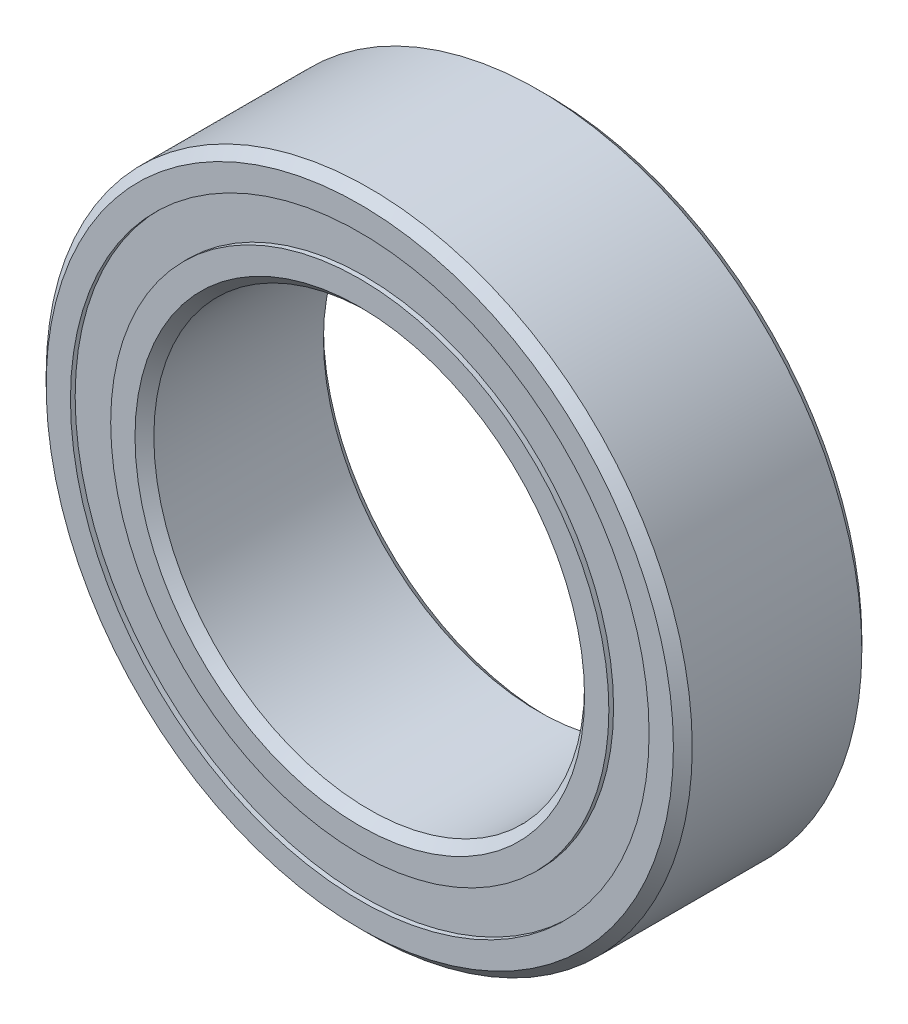
ISO-10303-21;
HEADER;
FILE_DESCRIPTION(('STEP AP214'),'2;1');
FILE_NAME('part.step','',(''),(''),'','','');
FILE_SCHEMA(('AUTOMOTIVE_DESIGN { 1 0 10303 214 1 1 1 1 }'));
ENDSEC;
DATA;
#1=APPLICATION_CONTEXT('core data for automotive mechanical design processes');
#2=APPLICATION_PROTOCOL_DEFINITION('international standard','automotive_design',2000,#1);
#3=PRODUCT_CONTEXT('',#1,'mechanical');
#4=PRODUCT('Part','Part','',(#3));
#5=PRODUCT_RELATED_PRODUCT_CATEGORY('part','',(#4));
#6=PRODUCT_DEFINITION_FORMATION('','',#4);
#7=PRODUCT_DEFINITION_CONTEXT('part definition',#1,'design');
#8=PRODUCT_DEFINITION('design','',#6,#7);
#9=PRODUCT_DEFINITION_SHAPE('','',#8);
#10=(LENGTH_UNIT() NAMED_UNIT(*) SI_UNIT(.MILLI.,.METRE.));
#11=(NAMED_UNIT(*) PLANE_ANGLE_UNIT() SI_UNIT($,.RADIAN.));
#12=(NAMED_UNIT(*) SI_UNIT($,.STERADIAN.) SOLID_ANGLE_UNIT());
#13=UNCERTAINTY_MEASURE_WITH_UNIT(LENGTH_MEASURE(1.E-05),#10,'distance_accuracy_value','');
#14=(GEOMETRIC_REPRESENTATION_CONTEXT(3) GLOBAL_UNCERTAINTY_ASSIGNED_CONTEXT((#13)) GLOBAL_UNIT_ASSIGNED_CONTEXT((#10,
#11,#12)) REPRESENTATION_CONTEXT('',''));
#15=CARTESIAN_POINT('',(0.,0.,0.));
#16=DIRECTION('',(0.,0.,1.));
#17=DIRECTION('',(1.,0.,0.));
#18=AXIS2_PLACEMENT_3D('',#15,#16,#17);
#19=CARTESIAN_POINT('',(0.,5.825,1.75));
#20=DIRECTION('',(0.,0.,-1.));
#21=DIRECTION('',(0.,-1.,0.));
#22=AXIS2_PLACEMENT_3D('',#19,#20,#21);
#23=PLANE('',#22);
#24=CARTESIAN_POINT('',(0.,0.,1.75));
#25=DIRECTION('',(0.,0.,1.));
#26=DIRECTION('',(1.,0.,0.));
#27=AXIS2_PLACEMENT_3D('',#24,#25,#26);
#28=CIRCLE('',#27,5.37362637362637);
#29=CARTESIAN_POINT('',(5.37362637362637,0.,1.75));
#30=VERTEX_POINT('',#29);
#31=EDGE_CURVE('P0_E61',#30,#30,#28,.T.);
#32=ORIENTED_EDGE('',*,*,#31,.F.);
#33=EDGE_LOOP('',(#32));
#34=FACE_BOUND('',#33,.T.);
#35=CARTESIAN_POINT('',(0.,0.,1.75));
#36=DIRECTION('',(0.,0.,1.));
#37=DIRECTION('',(1.,0.,0.));
#38=AXIS2_PLACEMENT_3D('',#35,#36,#37);
#39=CIRCLE('',#38,5.825);
#40=CARTESIAN_POINT('',(5.825,0.,1.75));
#41=VERTEX_POINT('',#40);
#42=EDGE_CURVE('P0_E10',#41,#41,#39,.T.);
#43=ORIENTED_EDGE('',*,*,#42,.T.);
#44=EDGE_LOOP('',(#43));
#45=FACE_BOUND('',#44,.T.);
#46=ADVANCED_FACE('P0_F15',(#34,#45),#23,.F.);
#47=CARTESIAN_POINT('',(0.,5.825,-1.75));
#48=DIRECTION('',(0.,0.,1.));
#49=DIRECTION('',(1.,0.,0.));
#50=AXIS2_PLACEMENT_3D('',#47,#48,#49);
#51=PLANE('',#50);
#52=CARTESIAN_POINT('',(0.,0.,-1.75));
#53=DIRECTION('',(0.,0.,1.));
#54=DIRECTION('',(1.,0.,0.));
#55=AXIS2_PLACEMENT_3D('',#52,#53,#54);
#56=CIRCLE('',#55,5.37362637362637);
#57=CARTESIAN_POINT('',(5.37362637362637,0.,-1.75));
#58=VERTEX_POINT('',#57);
#59=EDGE_CURVE('P0_E48',#58,#58,#56,.T.);
#60=ORIENTED_EDGE('',*,*,#59,.T.);
#61=EDGE_LOOP('',(#60));
#62=FACE_BOUND('',#61,.T.);
#63=CARTESIAN_POINT('',(0.,0.,-1.75));
#64=DIRECTION('',(0.,0.,1.));
#65=DIRECTION('',(1.,0.,0.));
#66=AXIS2_PLACEMENT_3D('',#63,#64,#65);
#67=CIRCLE('',#66,5.825);
#68=CARTESIAN_POINT('',(5.825,0.,-1.75));
#69=VERTEX_POINT('',#68);
#70=EDGE_CURVE('P0_E32',#69,#69,#67,.T.);
#71=ORIENTED_EDGE('',*,*,#70,.F.);
#72=EDGE_LOOP('',(#71));
#73=FACE_BOUND('',#72,.T.);
#74=ADVANCED_FACE('P0_F87',(#62,#73),#51,.F.);
#75=CARTESIAN_POINT('',(0.,0.,1.575));
#76=DIRECTION('',(0.,0.,-1.));
#77=DIRECTION('',(-1.,0.,0.));
#78=AXIS2_PLACEMENT_3D('',#75,#76,#77);
#79=CONICAL_SURFACE('',#78,6.,0.785398163397448);
#80=ORIENTED_EDGE('',*,*,#42,.F.);
#81=EDGE_LOOP('',(#80));
#82=FACE_BOUND('',#81,.T.);
#83=CARTESIAN_POINT('',(0.,0.,1.575));
#84=DIRECTION('',(0.,0.,1.));
#85=DIRECTION('',(1.,0.,0.));
#86=AXIS2_PLACEMENT_3D('',#83,#84,#85);
#87=CIRCLE('',#86,6.);
#88=CARTESIAN_POINT('',(6.,0.,1.575));
#89=VERTEX_POINT('',#88);
#90=EDGE_CURVE('P0_E22',#89,#89,#87,.T.);
#91=ORIENTED_EDGE('',*,*,#90,.T.);
#92=EDGE_LOOP('',(#91));
#93=FACE_BOUND('',#92,.T.);
#94=ADVANCED_FACE('P0_F95',(#82,#93),#79,.T.);
#95=CARTESIAN_POINT('',(0.,0.,1.75));
#96=DIRECTION('',(0.,0.,1.));
#97=DIRECTION('',(1.,0.,0.));
#98=AXIS2_PLACEMENT_3D('',#95,#96,#97);
#99=CYLINDRICAL_SURFACE('',#98,6.);
#100=CARTESIAN_POINT('',(0.,0.,-1.575));
#101=DIRECTION('',(0.,0.,1.));
#102=DIRECTION('',(1.,0.,0.));
#103=AXIS2_PLACEMENT_3D('',#100,#101,#102);
#104=CIRCLE('',#103,6.);
#105=CARTESIAN_POINT('',(6.,0.,-1.575));
#106=VERTEX_POINT('',#105);
#107=EDGE_CURVE('P0_E41',#106,#106,#104,.T.);
#108=ORIENTED_EDGE('',*,*,#107,.T.);
#109=EDGE_LOOP('',(#108));
#110=FACE_BOUND('',#109,.T.);
#111=ORIENTED_EDGE('',*,*,#90,.F.);
#112=EDGE_LOOP('',(#111));
#113=FACE_BOUND('',#112,.T.);
#114=ADVANCED_FACE('P0_F100',(#110,#113),#99,.T.);
#115=CARTESIAN_POINT('',(0.,0.,-1.75));
#116=DIRECTION('',(0.,0.,1.));
#117=DIRECTION('',(1.,0.,0.));
#118=AXIS2_PLACEMENT_3D('',#115,#116,#117);
#119=CONICAL_SURFACE('',#118,5.825,0.785398163397447);
#120=ORIENTED_EDGE('',*,*,#70,.T.);
#121=EDGE_LOOP('',(#120));
#122=FACE_BOUND('',#121,.T.);
#123=ORIENTED_EDGE('',*,*,#107,.F.);
#124=EDGE_LOOP('',(#123));
#125=FACE_BOUND('',#124,.T.);
#126=ADVANCED_FACE('P0_F102',(#122,#125),#119,.T.);
#127=CARTESIAN_POINT('',(0.,0.,1.75));
#128=DIRECTION('',(0.,0.,1.));
#129=DIRECTION('',(1.,0.,0.));
#130=AXIS2_PLACEMENT_3D('',#127,#128,#129);
#131=CYLINDRICAL_SURFACE('',#130,5.37362637362637);
#132=CARTESIAN_POINT('',(0.,0.,-0.777777777777777));
#133=DIRECTION('',(0.,0.,1.));
#134=DIRECTION('',(1.,0.,0.));
#135=AXIS2_PLACEMENT_3D('',#132,#133,#134);
#136=CIRCLE('',#135,5.37362637362637);
#137=CARTESIAN_POINT('',(5.37362637362637,0.,-0.777777777777777));
#138=VERTEX_POINT('',#137);
#139=EDGE_CURVE('P0_E42',#138,#138,#136,.T.);
#140=ORIENTED_EDGE('',*,*,#139,.T.);
#141=EDGE_LOOP('',(#140));
#142=FACE_BOUND('',#141,.T.);
#143=ORIENTED_EDGE('',*,*,#59,.F.);
#144=EDGE_LOOP('',(#143));
#145=FACE_BOUND('',#144,.T.);
#146=ADVANCED_FACE('P0_F81',(#142,#145),#131,.F.);
#147=CARTESIAN_POINT('',(0.,0.,0.));
#148=DIRECTION('',(0.,0.,1.));
#149=DIRECTION('',(1.,0.,0.));
#150=AXIS2_PLACEMENT_3D('',#147,#148,#149);
#151=TOROIDAL_SURFACE('',#150,5.,0.862864380232568);
#152=CARTESIAN_POINT('',(0.,0.,0.777777777777777));
#153=DIRECTION('',(0.,0.,1.));
#154=DIRECTION('',(1.,0.,0.));
#155=AXIS2_PLACEMENT_3D('',#152,#153,#154);
#156=CIRCLE('',#155,5.37362637362637);
#157=CARTESIAN_POINT('',(5.37362637362637,0.,0.777777777777777));
#158=VERTEX_POINT('',#157);
#159=EDGE_CURVE('P0_E66',#158,#158,#156,.T.);
#160=ORIENTED_EDGE('',*,*,#159,.T.);
#161=EDGE_LOOP('',(#160));
#162=FACE_BOUND('',#161,.T.);
#163=ORIENTED_EDGE('',*,*,#139,.F.);
#164=EDGE_LOOP('',(#163));
#165=FACE_BOUND('',#164,.T.);
#166=ADVANCED_FACE('P0_F73',(#162,#165),#151,.F.);
#167=CARTESIAN_POINT('',(0.,0.,1.75));
#168=DIRECTION('',(0.,0.,1.));
#169=DIRECTION('',(1.,0.,0.));
#170=AXIS2_PLACEMENT_3D('',#167,#168,#169);
#171=CYLINDRICAL_SURFACE('',#170,5.37362637362637);
#172=ORIENTED_EDGE('',*,*,#31,.T.);
#173=EDGE_LOOP('',(#172));
#174=FACE_BOUND('',#173,.T.);
#175=ORIENTED_EDGE('',*,*,#159,.F.);
#176=EDGE_LOOP('',(#175));
#177=FACE_BOUND('',#176,.T.);
#178=ADVANCED_FACE('P0_F76',(#174,#177),#171,.F.);
#179=CLOSED_SHELL('',(#46,#74,#94,#114,#126,#146,#166,#178));
#180=MANIFOLD_SOLID_BREP('P0_B1',#179);
#181=CARTESIAN_POINT('',(-2.50000000000004,-4.33012701892217,0.));
#182=DIRECTION('',(0.866025403784435,-0.500000000000007,0.));
#183=DIRECTION('',(-0.500000000000007,-0.866025403784435,0.));
#184=AXIS2_PLACEMENT_3D('',#181,#182,#183);
#185=SPHERICAL_SURFACE('',#184,0.862864380232568);
#186=CARTESIAN_POINT('',(-1.75273752669792,-4.76155920903846,0.));
#187=VERTEX_POINT('',#186);
#188=VERTEX_LOOP('',#187);
#189=FACE_BOUND('',#188,.T.);
#190=ADVANCED_FACE('P1_F13',(#189),#185,.T.);
#191=CLOSED_SHELL('',(#190));
#192=MANIFOLD_SOLID_BREP('P1_B1',#191);
#193=CARTESIAN_POINT('',(-4.33012701892222,-2.49999999999996,0.));
#194=DIRECTION('',(0.499999999999992,-0.866025403784443,0.));
#195=DIRECTION('',(-0.866025403784443,-0.499999999999992,0.));
#196=AXIS2_PLACEMENT_3D('',#193,#194,#195);
#197=SPHERICAL_SURFACE('',#196,0.862864380232568);
#198=CARTESIAN_POINT('',(-3.89869482880594,-3.24726247330208,0.));
#199=VERTEX_POINT('',#198);
#200=VERTEX_LOOP('',#199);
#201=FACE_BOUND('',#200,.T.);
#202=ADVANCED_FACE('P2_F13',(#201),#197,.T.);
#203=CLOSED_SHELL('',(#202));
#204=MANIFOLD_SOLID_BREP('P2_B1',#203);
#205=CARTESIAN_POINT('',(-5.,0.,0.));
#206=DIRECTION('',(0.,-1.,0.));
#207=DIRECTION('',(-1.,0.,0.));
#208=AXIS2_PLACEMENT_3D('',#205,#206,#207);
#209=SPHERICAL_SURFACE('',#208,0.862864380232568);
#210=CARTESIAN_POINT('',(-5.00000000000001,-0.862864380232516,0.));
#211=VERTEX_POINT('',#210);
#212=VERTEX_LOOP('',#211);
#213=FACE_BOUND('',#212,.T.);
#214=ADVANCED_FACE('P3_F13',(#213),#209,.T.);
#215=CLOSED_SHELL('',(#214));
#216=MANIFOLD_SOLID_BREP('P3_B1',#215);
#217=CARTESIAN_POINT('',(-4.33012701892217,2.50000000000005,0.));
#218=DIRECTION('',(-0.50000000000001,-0.866025403784433,0.));
#219=DIRECTION('',(-0.866025403784433,0.50000000000001,0.));
#220=AXIS2_PLACEMENT_3D('',#217,#218,#219);
#221=SPHERICAL_SURFACE('',#220,0.862864380232568);
#222=CARTESIAN_POINT('',(-4.76155920903846,1.75273752669794,0.));
#223=VERTEX_POINT('',#222);
#224=VERTEX_LOOP('',#223);
#225=FACE_BOUND('',#224,.T.);
#226=ADVANCED_FACE('P4_F13',(#225),#221,.T.);
#227=CLOSED_SHELL('',(#226));
#228=MANIFOLD_SOLID_BREP('P4_B1',#227);
#229=CARTESIAN_POINT('',(-2.49999999999994,4.33012701892222,0.));
#230=DIRECTION('',(-0.866025403784445,-0.499999999999989,0.));
#231=DIRECTION('',(-0.499999999999989,0.866025403784445,0.));
#232=AXIS2_PLACEMENT_3D('',#229,#230,#231);
#233=SPHERICAL_SURFACE('',#232,0.862864380232568);
#234=CARTESIAN_POINT('',(-3.24726247330207,3.89869482880594,0.));
#235=VERTEX_POINT('',#234);
#236=VERTEX_LOOP('',#235);
#237=FACE_BOUND('',#236,.T.);
#238=ADVANCED_FACE('P5_F13',(#237),#233,.T.);
#239=CLOSED_SHELL('',(#238));
#240=MANIFOLD_SOLID_BREP('P5_B1',#239);
#241=CARTESIAN_POINT('',(0.,5.37362637362637,0.862864380232568));
#242=DIRECTION('',(0.,0.,1.));
#243=DIRECTION('',(1.,0.,0.));
#244=AXIS2_PLACEMENT_3D('',#241,#242,#243);
#245=PLANE('',#244);
#246=CARTESIAN_POINT('',(0.,0.,0.862864380232568));
#247=DIRECTION('',(0.,0.,1.));
#248=DIRECTION('',(1.,0.,0.));
#249=AXIS2_PLACEMENT_3D('',#246,#247,#248);
#250=CIRCLE('',#249,4.62637362637364);
#251=CARTESIAN_POINT('',(4.62637362637364,0.,0.862864380232568));
#252=VERTEX_POINT('',#251);
#253=EDGE_CURVE('P6_E18',#252,#252,#250,.T.);
#254=ORIENTED_EDGE('',*,*,#253,.T.);
#255=EDGE_LOOP('',(#254));
#256=FACE_BOUND('',#255,.T.);
#257=CARTESIAN_POINT('',(0.,0.,0.862864380232568));
#258=DIRECTION('',(0.,0.,1.));
#259=DIRECTION('',(1.,0.,0.));
#260=AXIS2_PLACEMENT_3D('',#257,#258,#259);
#261=CIRCLE('',#260,5.37362637362637);
#262=CARTESIAN_POINT('',(5.37362637362637,0.,0.862864380232568));
#263=VERTEX_POINT('',#262);
#264=EDGE_CURVE('P6_E33',#263,#263,#261,.T.);
#265=ORIENTED_EDGE('',*,*,#264,.F.);
#266=EDGE_LOOP('',(#265));
#267=FACE_BOUND('',#266,.T.);
#268=ADVANCED_FACE('P6_F15',(#256,#267),#245,.F.);
#269=CARTESIAN_POINT('',(0.,5.37362637362637,1.6625));
#270=DIRECTION('',(0.,0.,-1.));
#271=DIRECTION('',(0.,-1.,0.));
#272=AXIS2_PLACEMENT_3D('',#269,#270,#271);
#273=PLANE('',#272);
#274=CARTESIAN_POINT('',(0.,0.,1.6625));
#275=DIRECTION('',(0.,0.,1.));
#276=DIRECTION('',(1.,0.,0.));
#277=AXIS2_PLACEMENT_3D('',#274,#275,#276);
#278=CIRCLE('',#277,4.62637362637364);
#279=CARTESIAN_POINT('',(4.62637362637364,0.,1.6625));
#280=VERTEX_POINT('',#279);
#281=EDGE_CURVE('P6_E10',#280,#280,#278,.T.);
#282=ORIENTED_EDGE('',*,*,#281,.F.);
#283=EDGE_LOOP('',(#282));
#284=FACE_BOUND('',#283,.T.);
#285=CARTESIAN_POINT('',(0.,0.,1.6625));
#286=DIRECTION('',(0.,0.,1.));
#287=DIRECTION('',(1.,0.,0.));
#288=AXIS2_PLACEMENT_3D('',#285,#286,#287);
#289=CIRCLE('',#288,5.37362637362637);
#290=CARTESIAN_POINT('',(5.37362637362637,0.,1.6625));
#291=VERTEX_POINT('',#290);
#292=EDGE_CURVE('P6_E38',#291,#291,#289,.T.);
#293=ORIENTED_EDGE('',*,*,#292,.T.);
#294=EDGE_LOOP('',(#293));
#295=FACE_BOUND('',#294,.T.);
#296=ADVANCED_FACE('P6_F43',(#284,#295),#273,.F.);
#297=CARTESIAN_POINT('',(0.,0.,1.75));
#298=DIRECTION('',(0.,0.,1.));
#299=DIRECTION('',(1.,0.,0.));
#300=AXIS2_PLACEMENT_3D('',#297,#298,#299);
#301=CYLINDRICAL_SURFACE('',#300,4.62637362637364);
#302=ORIENTED_EDGE('',*,*,#281,.T.);
#303=EDGE_LOOP('',(#302));
#304=FACE_BOUND('',#303,.T.);
#305=ORIENTED_EDGE('',*,*,#253,.F.);
#306=EDGE_LOOP('',(#305));
#307=FACE_BOUND('',#306,.T.);
#308=ADVANCED_FACE('P6_F50',(#304,#307),#301,.F.);
#309=CARTESIAN_POINT('',(0.,0.,1.75));
#310=DIRECTION('',(0.,0.,1.));
#311=DIRECTION('',(1.,0.,0.));
#312=AXIS2_PLACEMENT_3D('',#309,#310,#311);
#313=CYLINDRICAL_SURFACE('',#312,5.37362637362637);
#314=ORIENTED_EDGE('',*,*,#264,.T.);
#315=EDGE_LOOP('',(#314));
#316=FACE_BOUND('',#315,.T.);
#317=ORIENTED_EDGE('',*,*,#292,.F.);
#318=EDGE_LOOP('',(#317));
#319=FACE_BOUND('',#318,.T.);
#320=ADVANCED_FACE('P6_F44',(#316,#319),#313,.T.);
#321=CLOSED_SHELL('',(#268,#296,#308,#320));
#322=MANIFOLD_SOLID_BREP('P6_B1',#321);
#323=CARTESIAN_POINT('',(0.,5.37362637362637,-0.862864380232568));
#324=DIRECTION('',(0.,0.,-1.));
#325=DIRECTION('',(0.,-1.,0.));
#326=AXIS2_PLACEMENT_3D('',#323,#324,#325);
#327=PLANE('',#326);
#328=CARTESIAN_POINT('',(0.,0.,-0.862864380232568));
#329=DIRECTION('',(0.,0.,1.));
#330=DIRECTION('',(1.,0.,0.));
#331=AXIS2_PLACEMENT_3D('',#328,#329,#330);
#332=CIRCLE('',#331,4.62637362637364);
#333=CARTESIAN_POINT('',(4.62637362637364,0.,-0.862864380232568));
#334=VERTEX_POINT('',#333);
#335=EDGE_CURVE('P7_E10',#334,#334,#332,.T.);
#336=ORIENTED_EDGE('',*,*,#335,.F.);
#337=EDGE_LOOP('',(#336));
#338=FACE_BOUND('',#337,.T.);
#339=CARTESIAN_POINT('',(0.,0.,-0.862864380232568));
#340=DIRECTION('',(0.,0.,1.));
#341=DIRECTION('',(1.,0.,0.));
#342=AXIS2_PLACEMENT_3D('',#339,#340,#341);
#343=CIRCLE('',#342,5.37362637362637);
#344=CARTESIAN_POINT('',(5.37362637362637,0.,-0.862864380232568));
#345=VERTEX_POINT('',#344);
#346=EDGE_CURVE('P7_E36',#345,#345,#343,.T.);
#347=ORIENTED_EDGE('',*,*,#346,.T.);
#348=EDGE_LOOP('',(#347));
#349=FACE_BOUND('',#348,.T.);
#350=ADVANCED_FACE('P7_F15',(#338,#349),#327,.F.);
#351=CARTESIAN_POINT('',(0.,5.37362637362637,-1.6625));
#352=DIRECTION('',(0.,0.,1.));
#353=DIRECTION('',(1.,0.,0.));
#354=AXIS2_PLACEMENT_3D('',#351,#352,#353);
#355=PLANE('',#354);
#356=CARTESIAN_POINT('',(0.,0.,-1.6625));
#357=DIRECTION('',(0.,0.,1.));
#358=DIRECTION('',(1.,0.,0.));
#359=AXIS2_PLACEMENT_3D('',#356,#357,#358);
#360=CIRCLE('',#359,4.62637362637364);
#361=CARTESIAN_POINT('',(4.62637362637364,0.,-1.6625));
#362=VERTEX_POINT('',#361);
#363=EDGE_CURVE('P7_E22',#362,#362,#360,.T.);
#364=ORIENTED_EDGE('',*,*,#363,.T.);
#365=EDGE_LOOP('',(#364));
#366=FACE_BOUND('',#365,.T.);
#367=CARTESIAN_POINT('',(0.,0.,-1.6625));
#368=DIRECTION('',(0.,0.,1.));
#369=DIRECTION('',(1.,0.,0.));
#370=AXIS2_PLACEMENT_3D('',#367,#368,#369);
#371=CIRCLE('',#370,5.37362637362637);
#372=CARTESIAN_POINT('',(5.37362637362637,0.,-1.6625));
#373=VERTEX_POINT('',#372);
#374=EDGE_CURVE('P7_E33',#373,#373,#371,.T.);
#375=ORIENTED_EDGE('',*,*,#374,.F.);
#376=EDGE_LOOP('',(#375));
#377=FACE_BOUND('',#376,.T.);
#378=ADVANCED_FACE('P7_F60',(#366,#377),#355,.F.);
#379=CARTESIAN_POINT('',(0.,0.,1.75));
#380=DIRECTION('',(0.,0.,1.));
#381=DIRECTION('',(1.,0.,0.));
#382=AXIS2_PLACEMENT_3D('',#379,#380,#381);
#383=CYLINDRICAL_SURFACE('',#382,4.62637362637364);
#384=ORIENTED_EDGE('',*,*,#335,.T.);
#385=EDGE_LOOP('',(#384));
#386=FACE_BOUND('',#385,.T.);
#387=ORIENTED_EDGE('',*,*,#363,.F.);
#388=EDGE_LOOP('',(#387));
#389=FACE_BOUND('',#388,.T.);
#390=ADVANCED_FACE('P7_F49',(#386,#389),#383,.F.);
#391=CARTESIAN_POINT('',(0.,0.,1.75));
#392=DIRECTION('',(0.,0.,1.));
#393=DIRECTION('',(1.,0.,0.));
#394=AXIS2_PLACEMENT_3D('',#391,#392,#393);
#395=CYLINDRICAL_SURFACE('',#394,5.37362637362637);
#396=ORIENTED_EDGE('',*,*,#374,.T.);
#397=EDGE_LOOP('',(#396));
#398=FACE_BOUND('',#397,.T.);
#399=ORIENTED_EDGE('',*,*,#346,.F.);
#400=EDGE_LOOP('',(#399));
#401=FACE_BOUND('',#400,.T.);
#402=ADVANCED_FACE('P7_F48',(#398,#401),#395,.T.);
#403=CLOSED_SHELL('',(#350,#378,#390,#402));
#404=MANIFOLD_SOLID_BREP('P7_B1',#403);
#405=CARTESIAN_POINT('',(0.,4.175,-1.75));
#406=DIRECTION('',(0.,0.,1.));
#407=DIRECTION('',(1.,0.,0.));
#408=AXIS2_PLACEMENT_3D('',#405,#406,#407);
#409=PLANE('',#408);
#410=CARTESIAN_POINT('',(0.,0.,-1.75));
#411=DIRECTION('',(0.,0.,1.));
#412=DIRECTION('',(1.,0.,0.));
#413=AXIS2_PLACEMENT_3D('',#410,#411,#412);
#414=CIRCLE('',#413,4.175);
#415=CARTESIAN_POINT('',(4.175,0.,-1.75));
#416=VERTEX_POINT('',#415);
#417=EDGE_CURVE('P8_E33',#416,#416,#414,.T.);
#418=ORIENTED_EDGE('',*,*,#417,.T.);
#419=EDGE_LOOP('',(#418));
#420=FACE_BOUND('',#419,.T.);
#421=CARTESIAN_POINT('',(0.,0.,-1.75));
#422=DIRECTION('',(0.,0.,1.));
#423=DIRECTION('',(1.,0.,0.));
#424=AXIS2_PLACEMENT_3D('',#421,#422,#423);
#425=CIRCLE('',#424,4.62637362637364);
#426=CARTESIAN_POINT('',(4.62637362637364,0.,-1.75));
#427=VERTEX_POINT('',#426);
#428=EDGE_CURVE('P8_E22',#427,#427,#425,.T.);
#429=ORIENTED_EDGE('',*,*,#428,.F.);
#430=EDGE_LOOP('',(#429));
#431=FACE_BOUND('',#430,.T.);
#432=ADVANCED_FACE('P8_F15',(#420,#431),#409,.F.);
#433=CARTESIAN_POINT('',(0.,4.62637362637364,1.75));
#434=DIRECTION('',(0.,0.,-1.));
#435=DIRECTION('',(0.,-1.,0.));
#436=AXIS2_PLACEMENT_3D('',#433,#434,#435);
#437=PLANE('',#436);
#438=CARTESIAN_POINT('',(0.,0.,1.75));
#439=DIRECTION('',(0.,0.,1.));
#440=DIRECTION('',(1.,0.,0.));
#441=AXIS2_PLACEMENT_3D('',#438,#439,#440);
#442=CIRCLE('',#441,4.175);
#443=CARTESIAN_POINT('',(4.175,0.,1.75));
#444=VERTEX_POINT('',#443);
#445=EDGE_CURVE('P8_E51',#444,#444,#442,.T.);
#446=ORIENTED_EDGE('',*,*,#445,.F.);
#447=EDGE_LOOP('',(#446));
#448=FACE_BOUND('',#447,.T.);
#449=CARTESIAN_POINT('',(0.,0.,1.75));
#450=DIRECTION('',(0.,0.,1.));
#451=DIRECTION('',(1.,0.,0.));
#452=AXIS2_PLACEMENT_3D('',#449,#450,#451);
#453=CIRCLE('',#452,4.62637362637364);
#454=CARTESIAN_POINT('',(4.62637362637364,0.,1.75));
#455=VERTEX_POINT('',#454);
#456=EDGE_CURVE('P8_E10',#455,#455,#453,.T.);
#457=ORIENTED_EDGE('',*,*,#456,.T.);
#458=EDGE_LOOP('',(#457));
#459=FACE_BOUND('',#458,.T.);
#460=ADVANCED_FACE('P8_F85',(#448,#459),#437,.F.);
#461=CARTESIAN_POINT('',(0.,0.,1.75));
#462=DIRECTION('',(0.,0.,1.));
#463=DIRECTION('',(1.,0.,0.));
#464=AXIS2_PLACEMENT_3D('',#461,#462,#463);
#465=CYLINDRICAL_SURFACE('',#464,4.62637362637364);
#466=CARTESIAN_POINT('',(0.,0.,0.777777777777777));
#467=DIRECTION('',(0.,0.,1.));
#468=DIRECTION('',(1.,0.,0.));
#469=AXIS2_PLACEMENT_3D('',#466,#467,#468);
#470=CIRCLE('',#469,4.62637362637364);
#471=CARTESIAN_POINT('',(4.62637362637364,0.,0.777777777777777));
#472=VERTEX_POINT('',#471);
#473=EDGE_CURVE('P8_E45',#472,#472,#470,.T.);
#474=ORIENTED_EDGE('',*,*,#473,.T.);
#475=EDGE_LOOP('',(#474));
#476=FACE_BOUND('',#475,.T.);
#477=ORIENTED_EDGE('',*,*,#456,.F.);
#478=EDGE_LOOP('',(#477));
#479=FACE_BOUND('',#478,.T.);
#480=ADVANCED_FACE('P8_F87',(#476,#479),#465,.T.);
#481=CARTESIAN_POINT('',(0.,0.,1.75));
#482=DIRECTION('',(0.,0.,1.));
#483=DIRECTION('',(1.,0.,0.));
#484=AXIS2_PLACEMENT_3D('',#481,#482,#483);
#485=CYLINDRICAL_SURFACE('',#484,4.62637362637364);
#486=ORIENTED_EDGE('',*,*,#428,.T.);
#487=EDGE_LOOP('',(#486));
#488=FACE_BOUND('',#487,.T.);
#489=CARTESIAN_POINT('',(0.,0.,-0.77777777777778));
#490=DIRECTION('',(0.,0.,1.));
#491=DIRECTION('',(1.,0.,0.));
#492=AXIS2_PLACEMENT_3D('',#489,#490,#491);
#493=CIRCLE('',#492,4.62637362637364);
#494=CARTESIAN_POINT('',(4.62637362637364,0.,-0.77777777777778));
#495=VERTEX_POINT('',#494);
#496=EDGE_CURVE('P8_E43',#495,#495,#493,.T.);
#497=ORIENTED_EDGE('',*,*,#496,.F.);
#498=EDGE_LOOP('',(#497));
#499=FACE_BOUND('',#498,.T.);
#500=ADVANCED_FACE('P8_F77',(#488,#499),#485,.T.);
#501=CARTESIAN_POINT('',(0.,0.,-1.575));
#502=DIRECTION('',(0.,0.,-1.));
#503=DIRECTION('',(-1.,0.,0.));
#504=AXIS2_PLACEMENT_3D('',#501,#502,#503);
#505=CONICAL_SURFACE('',#504,4.,0.785398163397447);
#506=ORIENTED_EDGE('',*,*,#417,.F.);
#507=EDGE_LOOP('',(#506));
#508=FACE_BOUND('',#507,.T.);
#509=CARTESIAN_POINT('',(0.,0.,-1.575));
#510=DIRECTION('',(0.,0.,1.));
#511=DIRECTION('',(1.,0.,0.));
#512=AXIS2_PLACEMENT_3D('',#509,#510,#511);
#513=CIRCLE('',#512,4.);
#514=CARTESIAN_POINT('',(4.,0.,-1.575));
#515=VERTEX_POINT('',#514);
#516=EDGE_CURVE('P8_E39',#515,#515,#513,.T.);
#517=ORIENTED_EDGE('',*,*,#516,.T.);
#518=EDGE_LOOP('',(#517));
#519=FACE_BOUND('',#518,.T.);
#520=ADVANCED_FACE('P8_F64',(#508,#519),#505,.F.);
#521=CARTESIAN_POINT('',(0.,0.,1.75));
#522=DIRECTION('',(0.,0.,1.));
#523=DIRECTION('',(1.,0.,0.));
#524=AXIS2_PLACEMENT_3D('',#521,#522,#523);
#525=CYLINDRICAL_SURFACE('',#524,4.);
#526=CARTESIAN_POINT('',(0.,0.,1.575));
#527=DIRECTION('',(0.,0.,1.));
#528=DIRECTION('',(1.,0.,0.));
#529=AXIS2_PLACEMENT_3D('',#526,#527,#528);
#530=CIRCLE('',#529,4.);
#531=CARTESIAN_POINT('',(4.,0.,1.575));
#532=VERTEX_POINT('',#531);
#533=EDGE_CURVE('P8_E50',#532,#532,#530,.T.);
#534=ORIENTED_EDGE('',*,*,#533,.T.);
#535=EDGE_LOOP('',(#534));
#536=FACE_BOUND('',#535,.T.);
#537=ORIENTED_EDGE('',*,*,#516,.F.);
#538=EDGE_LOOP('',(#537));
#539=FACE_BOUND('',#538,.T.);
#540=ADVANCED_FACE('P8_F65',(#536,#539),#525,.F.);
#541=CARTESIAN_POINT('',(0.,0.,1.75));
#542=DIRECTION('',(0.,0.,1.));
#543=DIRECTION('',(1.,0.,0.));
#544=AXIS2_PLACEMENT_3D('',#541,#542,#543);
#545=CONICAL_SURFACE('',#544,4.175,0.785398163397448);
#546=ORIENTED_EDGE('',*,*,#445,.T.);
#547=EDGE_LOOP('',(#546));
#548=FACE_BOUND('',#547,.T.);
#549=ORIENTED_EDGE('',*,*,#533,.F.);
#550=EDGE_LOOP('',(#549));
#551=FACE_BOUND('',#550,.T.);
#552=ADVANCED_FACE('P8_F70',(#548,#551),#545,.F.);
#553=CARTESIAN_POINT('',(0.,0.,0.));
#554=DIRECTION('',(0.,0.,1.));
#555=DIRECTION('',(1.,0.,0.));
#556=AXIS2_PLACEMENT_3D('',#553,#554,#555);
#557=TOROIDAL_SURFACE('',#556,5.,0.862864380232566);
#558=ORIENTED_EDGE('',*,*,#496,.T.);
#559=EDGE_LOOP('',(#558));
#560=FACE_BOUND('',#559,.T.);
#561=ORIENTED_EDGE('',*,*,#473,.F.);
#562=EDGE_LOOP('',(#561));
#563=FACE_BOUND('',#562,.T.);
#564=ADVANCED_FACE('P8_F74',(#560,#563),#557,.F.);
#565=CLOSED_SHELL('',(#432,#460,#480,#500,#520,#540,#552,#564));
#566=MANIFOLD_SOLID_BREP('P8_B1',#565);
#567=CARTESIAN_POINT('',(0.,5.,0.));
#568=DIRECTION('',(-1.,0.,0.));
#569=DIRECTION('',(0.,1.,0.));
#570=AXIS2_PLACEMENT_3D('',#567,#568,#569);
#571=SPHERICAL_SURFACE('',#570,0.862864380232568);
#572=CARTESIAN_POINT('',(-0.862864380232568,5.,0.));
#573=VERTEX_POINT('',#572);
#574=VERTEX_LOOP('',#573);
#575=FACE_BOUND('',#574,.T.);
#576=ADVANCED_FACE('P9_F13',(#575),#571,.T.);
#577=CLOSED_SHELL('',(#576));
#578=MANIFOLD_SOLID_BREP('P9_B1',#577);
#579=CARTESIAN_POINT('',(2.5,4.33012701892219,0.));
#580=DIRECTION('',(-0.866025403784438,0.5,0.));
#581=DIRECTION('',(0.5,0.866025403784438,0.));
#582=AXIS2_PLACEMENT_3D('',#579,#580,#581);
#583=SPHERICAL_SURFACE('',#582,0.862864380232568);
#584=CARTESIAN_POINT('',(1.75273752669788,4.76155920903847,0.));
#585=VERTEX_POINT('',#584);
#586=VERTEX_LOOP('',#585);
#587=FACE_BOUND('',#586,.T.);
#588=ADVANCED_FACE('P10_F13',(#587),#583,.T.);
#589=CLOSED_SHELL('',(#588));
#590=MANIFOLD_SOLID_BREP('P10_B1',#589);
#591=CARTESIAN_POINT('',(4.33012701892219,2.5,0.));
#592=DIRECTION('',(-0.5,0.86602540378444,0.));
#593=DIRECTION('',(0.86602540378444,0.5,0.));
#594=AXIS2_PLACEMENT_3D('',#591,#592,#593);
#595=SPHERICAL_SURFACE('',#594,0.862864380232568);
#596=CARTESIAN_POINT('',(3.89869482880591,3.24726247330212,0.));
#597=VERTEX_POINT('',#596);
#598=VERTEX_LOOP('',#597);
#599=FACE_BOUND('',#598,.T.);
#600=ADVANCED_FACE('P11_F13',(#599),#595,.T.);
#601=CLOSED_SHELL('',(#600));
#602=MANIFOLD_SOLID_BREP('P11_B1',#601);
#603=CARTESIAN_POINT('',(5.,0.,0.));
#604=DIRECTION('',(0.,1.,0.));
#605=DIRECTION('',(1.,0.,0.));
#606=AXIS2_PLACEMENT_3D('',#603,#604,#605);
#607=SPHERICAL_SURFACE('',#606,0.862864380232568);
#608=CARTESIAN_POINT('',(5.,0.862864380232551,0.));
#609=VERTEX_POINT('',#608);
#610=VERTEX_LOOP('',#609);
#611=FACE_BOUND('',#610,.T.);
#612=ADVANCED_FACE('P12_F13',(#611),#607,.T.);
#613=CLOSED_SHELL('',(#612));
#614=MANIFOLD_SOLID_BREP('P12_B1',#613);
#615=CARTESIAN_POINT('',(4.33012701892219,-2.5,0.));
#616=DIRECTION('',(0.5,0.866025403784436,0.));
#617=DIRECTION('',(0.866025403784436,-0.5,0.));
#618=AXIS2_PLACEMENT_3D('',#615,#616,#617);
#619=SPHERICAL_SURFACE('',#618,0.862864380232568);
#620=CARTESIAN_POINT('',(4.76155920903847,-1.75273752669788,0.));
#621=VERTEX_POINT('',#620);
#622=VERTEX_LOOP('',#621);
#623=FACE_BOUND('',#622,.T.);
#624=ADVANCED_FACE('P13_F13',(#623),#619,.T.);
#625=CLOSED_SHELL('',(#624));
#626=MANIFOLD_SOLID_BREP('P13_B1',#625);
#627=CARTESIAN_POINT('',(2.49999999999997,-4.33012701892222,0.));
#628=DIRECTION('',(0.866025403784442,0.5,0.));
#629=DIRECTION('',(0.5,-0.866025403784442,0.));
#630=AXIS2_PLACEMENT_3D('',#627,#628,#629);
#631=SPHERICAL_SURFACE('',#630,0.862864380232568);
#632=CARTESIAN_POINT('',(3.2472624733021,-3.89869482880593,0.));
#633=VERTEX_POINT('',#632);
#634=VERTEX_LOOP('',#633);
#635=FACE_BOUND('',#634,.T.);
#636=ADVANCED_FACE('P14_F13',(#635),#631,.T.);
#637=CLOSED_SHELL('',(#636));
#638=MANIFOLD_SOLID_BREP('P14_B1',#637);
#639=CARTESIAN_POINT('',(0.,-5.,0.));
#640=DIRECTION('',(1.,0.,0.));
#641=DIRECTION('',(0.,-1.,0.));
#642=AXIS2_PLACEMENT_3D('',#639,#640,#641);
#643=SPHERICAL_SURFACE('',#642,0.862864380232568);
#644=CARTESIAN_POINT('',(0.862864380232533,-5.00000000000001,0.));
#645=VERTEX_POINT('',#644);
#646=VERTEX_LOOP('',#645);
#647=FACE_BOUND('',#646,.T.);
#648=ADVANCED_FACE('P15_F13',(#647),#643,.T.);
#649=CLOSED_SHELL('',(#648));
#650=MANIFOLD_SOLID_BREP('P15_B1',#649);
#651=ADVANCED_BREP_SHAPE_REPRESENTATION('',(#18,#180,#192,#204,#216,#228,#240,#322,#404,#566,
#578,#590,#602,#614,#626,#638,#650),#14);
#652=SHAPE_DEFINITION_REPRESENTATION(#9,#651);
ENDSEC;
END-ISO-10303-21;
